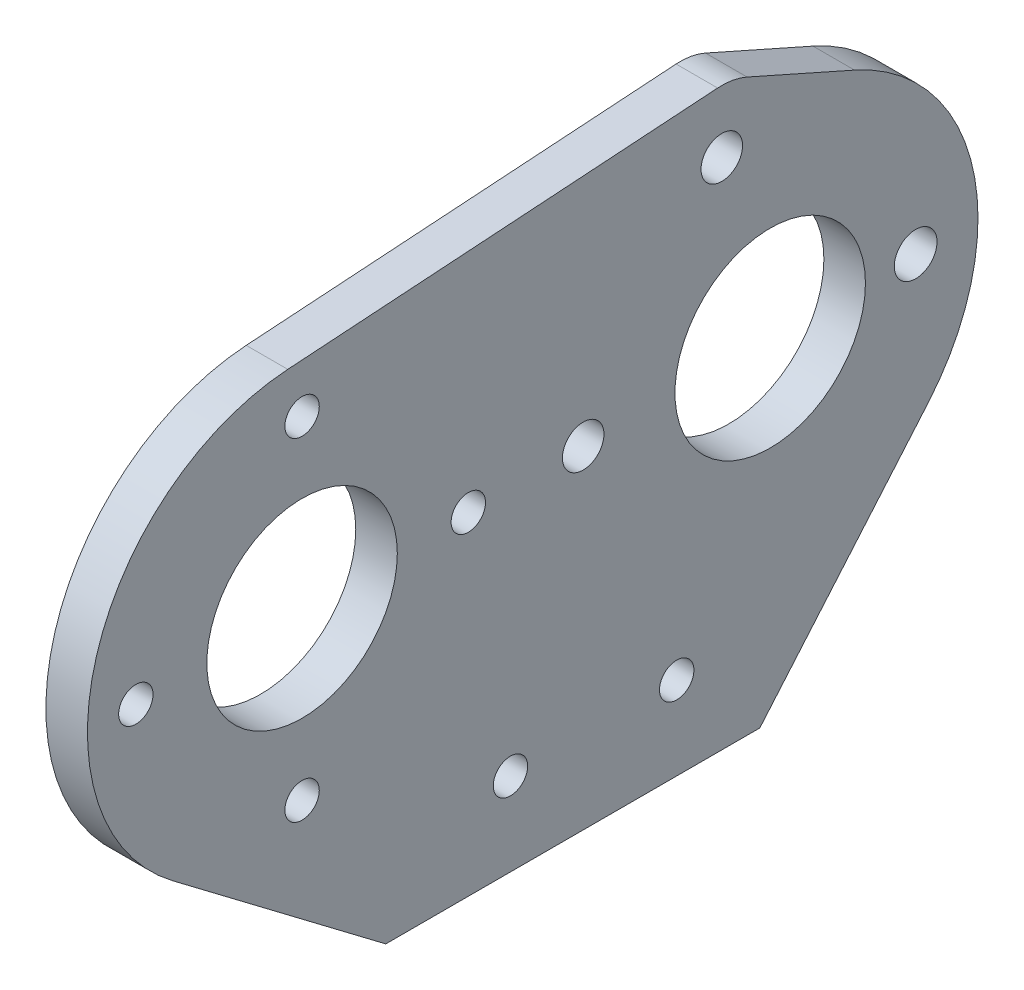
ISO-10303-21;
HEADER;
FILE_DESCRIPTION(('STEP AP214'),'2;1');
FILE_NAME('part.step','',(''),(''),'','','');
FILE_SCHEMA(('AUTOMOTIVE_DESIGN { 1 0 10303 214 1 1 1 1 }'));
ENDSEC;
DATA;
#1=APPLICATION_CONTEXT('core data for automotive mechanical design processes');
#2=APPLICATION_PROTOCOL_DEFINITION('international standard','automotive_design',2000,#1);
#3=PRODUCT_CONTEXT('',#1,'mechanical');
#4=PRODUCT('Part','Part','',(#3));
#5=PRODUCT_RELATED_PRODUCT_CATEGORY('part','',(#4));
#6=PRODUCT_DEFINITION_FORMATION('','',#4);
#7=PRODUCT_DEFINITION_CONTEXT('part definition',#1,'design');
#8=PRODUCT_DEFINITION('design','',#6,#7);
#9=PRODUCT_DEFINITION_SHAPE('','',#8);
#10=(LENGTH_UNIT() NAMED_UNIT(*) SI_UNIT(.MILLI.,.METRE.));
#11=(NAMED_UNIT(*) PLANE_ANGLE_UNIT() SI_UNIT($,.RADIAN.));
#12=(NAMED_UNIT(*) SI_UNIT($,.STERADIAN.) SOLID_ANGLE_UNIT());
#13=UNCERTAINTY_MEASURE_WITH_UNIT(LENGTH_MEASURE(1.E-05),#10,'distance_accuracy_value','');
#14=(GEOMETRIC_REPRESENTATION_CONTEXT(3) GLOBAL_UNCERTAINTY_ASSIGNED_CONTEXT((#13)) GLOBAL_UNIT_ASSIGNED_CONTEXT((#10,
#11,#12)) REPRESENTATION_CONTEXT('',''));
#15=CARTESIAN_POINT('',(0.,0.,0.));
#16=DIRECTION('',(0.,0.,1.));
#17=DIRECTION('',(1.,0.,0.));
#18=AXIS2_PLACEMENT_3D('',#15,#16,#17);
#19=CARTESIAN_POINT('',(6.35,50.8,-77.7875));
#20=DIRECTION('',(1.,0.,0.));
#21=DIRECTION('',(0.,0.,-1.));
#22=AXIS2_PLACEMENT_3D('',#19,#20,#21);
#23=PLANE('',#22);
#24=CARTESIAN_POINT('',(6.35,78.4013304862101,-70.3917457861956));
#25=DIRECTION('',(1.,0.,0.));
#26=DIRECTION('',(0.,0.,-1.));
#27=AXIS2_PLACEMENT_3D('',#24,#25,#26);
#28=CIRCLE('',#27,3.175);
#29=CARTESIAN_POINT('',(6.35,78.4013304862101,-73.5667457861956));
#30=VERTEX_POINT('',#29);
#31=EDGE_CURVE('E234',#30,#30,#28,.T.);
#32=ORIENTED_EDGE('',*,*,#31,.F.);
#33=EDGE_LOOP('',(#32));
#34=FACE_BOUND('',#33,.T.);
#35=CARTESIAN_POINT('',(6.35,50.8,19.1389));
#36=DIRECTION('',(1.,0.,0.));
#37=DIRECTION('',(0.,0.,-1.));
#38=AXIS2_PLACEMENT_3D('',#35,#36,#37);
#39=CIRCLE('',#38,2.62890000000003);
#40=CARTESIAN_POINT('',(6.35,50.8,16.51));
#41=VERTEX_POINT('',#40);
#42=EDGE_CURVE('E222',#41,#41,#39,.T.);
#43=ORIENTED_EDGE('',*,*,#42,.F.);
#44=EDGE_LOOP('',(#43));
#45=FACE_BOUND('',#44,.T.);
#46=CARTESIAN_POINT('',(6.35,25.4,-6.26110000000001));
#47=DIRECTION('',(1.,0.,0.));
#48=DIRECTION('',(0.,0.,-1.));
#49=AXIS2_PLACEMENT_3D('',#46,#47,#48);
#50=CIRCLE('',#49,2.62890000000002);
#51=CARTESIAN_POINT('',(6.35,25.4,-8.89000000000003));
#52=VERTEX_POINT('',#51);
#53=EDGE_CURVE('E210',#52,#52,#50,.T.);
#54=ORIENTED_EDGE('',*,*,#53,.F.);
#55=EDGE_LOOP('',(#54));
#56=FACE_BOUND('',#55,.T.);
#57=CARTESIAN_POINT('',(6.35,50.8,-77.7875));
#58=DIRECTION('',(1.,0.,0.));
#59=DIRECTION('',(0.,0.,-1.));
#60=AXIS2_PLACEMENT_3D('',#57,#58,#59);
#61=CIRCLE('',#60,14.5542);
#62=CARTESIAN_POINT('',(6.35,50.8,-92.3417));
#63=VERTEX_POINT('',#62);
#64=EDGE_CURVE('E198',#63,#63,#61,.T.);
#65=ORIENTED_EDGE('',*,*,#64,.F.);
#66=EDGE_LOOP('',(#65));
#67=FACE_BOUND('',#66,.T.);
#68=CARTESIAN_POINT('',(6.35,12.7,-38.1));
#69=DIRECTION('',(1.,0.,0.));
#70=DIRECTION('',(0.,0.,-1.));
#71=AXIS2_PLACEMENT_3D('',#68,#69,#70);
#72=CIRCLE('',#71,2.6289);
#73=CARTESIAN_POINT('',(6.35,12.7,-40.7289));
#74=VERTEX_POINT('',#73);
#75=EDGE_CURVE('E186',#74,#74,#72,.T.);
#76=ORIENTED_EDGE('',*,*,#75,.F.);
#77=EDGE_LOOP('',(#76));
#78=FACE_BOUND('',#77,.T.);
#79=DIRECTION('',(0.,0.,-1.));
#80=VECTOR('',#79,1.);
#81=CARTESIAN_POINT('',(6.35,0.,-19.05));
#82=LINE('',#81,#80);
#83=CARTESIAN_POINT('',(6.35,0.,-19.05));
#84=VERTEX_POINT('',#83);
#85=CARTESIAN_POINT('',(6.35,0.,-76.2));
#86=VERTEX_POINT('',#85);
#87=EDGE_CURVE('E149',#84,#86,#82,.T.);
#88=ORIENTED_EDGE('',*,*,#87,.T.);
#89=DIRECTION('',(0.,0.760975609756097,-0.648780487804878));
#90=VECTOR('',#89,1.);
#91=CARTESIAN_POINT('',(6.35,0.,-76.2));
#92=LINE('',#91,#90);
#93=CARTESIAN_POINT('',(6.35,30.2012195121951,-101.948475609756));
#94=VERTEX_POINT('',#93);
#95=EDGE_CURVE('E97',#86,#94,#92,.T.);
#96=ORIENTED_EDGE('',*,*,#95,.T.);
#97=CARTESIAN_POINT('',(6.35,50.8,-77.7875));
#98=DIRECTION('',(1.,0.,0.));
#99=DIRECTION('',(0.,0.,-1.));
#100=AXIS2_PLACEMENT_3D('',#97,#98,#99);
#101=CIRCLE('',#100,31.75);
#102=CARTESIAN_POINT('',(6.35,79.818026797041,-90.6722437229544));
#103=VERTEX_POINT('',#102);
#104=EDGE_CURVE('E164',#94,#103,#101,.T.);
#105=ORIENTED_EDGE('',*,*,#104,.T.);
#106=DIRECTION('',(0.,0.405818699935571,0.913953599906802));
#107=VECTOR('',#106,1.);
#108=CARTESIAN_POINT('',(6.35,79.818026797041,-90.6722437229544));
#109=LINE('',#108,#107);
#110=CARTESIAN_POINT('',(6.35,87.1067385253224,-74.2571689030819));
#111=VERTEX_POINT('',#110);
#112=EDGE_CURVE('E177',#103,#111,#109,.T.);
#113=ORIENTED_EDGE('',*,*,#112,.T.);
#114=CARTESIAN_POINT('',(6.35,78.4013304862101,-70.3917457861956));
#115=DIRECTION('',(1.,0.,0.));
#116=DIRECTION('',(0.,0.,1.));
#117=AXIS2_PLACEMENT_3D('',#114,#115,#116);
#118=CIRCLE('',#117,9.52500000000001);
#119=CARTESIAN_POINT('',(6.35,87.9051580954357,-69.7570129493875));
#120=VERTEX_POINT('',#119);
#121=EDGE_CURVE('E116',#111,#120,#118,.T.);
#122=ORIENTED_EDGE('',*,*,#121,.T.);
#123=DIRECTION('',(0.,-0.0666386180375886,0.997777176821579));
#124=VECTOR('',#123,1.);
#125=CARTESIAN_POINT('',(6.35,87.9051580954357,-69.7570129493875));
#126=LINE('',#125,#124);
#127=CARTESIAN_POINT('',(6.35,83.5185105160271,-4.07592642048224));
#128=VERTEX_POINT('',#127);
#129=EDGE_CURVE('E110',#120,#128,#126,.T.);
#130=ORIENTED_EDGE('',*,*,#129,.T.);
#131=CARTESIAN_POINT('',(6.35,50.8,-6.26110000000001));
#132=DIRECTION('',(1.,0.,0.));
#133=DIRECTION('',(0.,0.,-1.));
#134=AXIS2_PLACEMENT_3D('',#131,#132,#133);
#135=CIRCLE('',#134,32.7914);
#136=CARTESIAN_POINT('',(6.35,24.6516746454702,13.5262948541402));
#137=VERTEX_POINT('',#136);
#138=EDGE_CURVE('E114',#128,#137,#135,.T.);
#139=ORIENTED_EDGE('',*,*,#138,.T.);
#140=DIRECTION('',(0.,-0.603432450402856,-0.797414119388919));
#141=VECTOR('',#140,1.);
#142=CARTESIAN_POINT('',(6.35,0.,-19.05));
#143=LINE('',#142,#141);
#144=EDGE_CURVE('E54',#137,#84,#143,.T.);
#145=ORIENTED_EDGE('',*,*,#144,.T.);
#146=EDGE_LOOP('',(#88,#96,#105,#113,#122,#130,#139,#145));
#147=FACE_BOUND('',#146,.T.);
#148=CARTESIAN_POINT('',(6.35,50.8,-6.26110000000001));
#149=DIRECTION('',(1.,0.,0.));
#150=DIRECTION('',(0.,0.,-1.));
#151=AXIS2_PLACEMENT_3D('',#148,#149,#150);
#152=CIRCLE('',#151,14.5542);
#153=CARTESIAN_POINT('',(6.35,50.8,-20.8153));
#154=VERTEX_POINT('',#153);
#155=EDGE_CURVE('E138',#154,#154,#152,.T.);
#156=ORIENTED_EDGE('',*,*,#155,.F.);
#157=EDGE_LOOP('',(#156));
#158=FACE_BOUND('',#157,.T.);
#159=CARTESIAN_POINT('',(6.35,12.7,-63.5));
#160=DIRECTION('',(1.,0.,0.));
#161=DIRECTION('',(0.,0.,-1.));
#162=AXIS2_PLACEMENT_3D('',#159,#160,#161);
#163=CIRCLE('',#162,2.62890000000001);
#164=CARTESIAN_POINT('',(6.35,12.7,-66.1289));
#165=VERTEX_POINT('',#164);
#166=EDGE_CURVE('E192',#165,#165,#163,.T.);
#167=ORIENTED_EDGE('',*,*,#166,.F.);
#168=EDGE_LOOP('',(#167));
#169=FACE_BOUND('',#168,.T.);
#170=CARTESIAN_POINT('',(6.35,76.2,-6.26110000000001));
#171=DIRECTION('',(1.,0.,0.));
#172=DIRECTION('',(0.,0.,-1.));
#173=AXIS2_PLACEMENT_3D('',#170,#171,#172);
#174=CIRCLE('',#173,2.62890000000003);
#175=CARTESIAN_POINT('',(6.35,76.2,-8.89000000000004));
#176=VERTEX_POINT('',#175);
#177=EDGE_CURVE('E204',#176,#176,#174,.T.);
#178=ORIENTED_EDGE('',*,*,#177,.F.);
#179=EDGE_LOOP('',(#178));
#180=FACE_BOUND('',#179,.T.);
#181=CARTESIAN_POINT('',(6.35,50.8,-31.6611));
#182=DIRECTION('',(1.,0.,0.));
#183=DIRECTION('',(0.,0.,-1.));
#184=AXIS2_PLACEMENT_3D('',#181,#182,#183);
#185=CIRCLE('',#184,2.62890000000003);
#186=CARTESIAN_POINT('',(6.35,50.8,-34.29));
#187=VERTEX_POINT('',#186);
#188=EDGE_CURVE('E216',#187,#187,#185,.T.);
#189=ORIENTED_EDGE('',*,*,#188,.F.);
#190=EDGE_LOOP('',(#189));
#191=FACE_BOUND('',#190,.T.);
#192=CARTESIAN_POINT('',(6.35,50.8,-49.2125));
#193=DIRECTION('',(1.,0.,0.));
#194=DIRECTION('',(0.,0.,-1.));
#195=AXIS2_PLACEMENT_3D('',#192,#193,#194);
#196=CIRCLE('',#195,3.175);
#197=CARTESIAN_POINT('',(6.35,50.8,-52.3875));
#198=VERTEX_POINT('',#197);
#199=EDGE_CURVE('E228',#198,#198,#196,.T.);
#200=ORIENTED_EDGE('',*,*,#199,.F.);
#201=EDGE_LOOP('',(#200));
#202=FACE_BOUND('',#201,.T.);
#203=CARTESIAN_POINT('',(6.35,50.8,-100.0125));
#204=DIRECTION('',(1.,0.,0.));
#205=DIRECTION('',(0.,0.,-1.));
#206=AXIS2_PLACEMENT_3D('',#203,#204,#205);
#207=CIRCLE('',#206,3.2639);
#208=CARTESIAN_POINT('',(6.35,50.8,-103.2764));
#209=VERTEX_POINT('',#208);
#210=EDGE_CURVE('E240',#209,#209,#207,.T.);
#211=ORIENTED_EDGE('',*,*,#210,.F.);
#212=EDGE_LOOP('',(#211));
#213=FACE_BOUND('',#212,.T.);
#214=ADVANCED_FACE('F37',(#34,#45,#56,#67,#78,#147,#158,#169,#180,#191,#202,#213),#23,.T.);
#215=CARTESIAN_POINT('',(0.,50.8,-77.7875));
#216=DIRECTION('',(1.,0.,0.));
#217=DIRECTION('',(0.,0.,-1.));
#218=AXIS2_PLACEMENT_3D('',#215,#216,#217);
#219=PLANE('',#218);
#220=DIRECTION('',(0.,0.,-1.));
#221=VECTOR('',#220,1.);
#222=CARTESIAN_POINT('',(0.,0.,-19.05));
#223=LINE('',#222,#221);
#224=CARTESIAN_POINT('',(0.,0.,-19.05));
#225=VERTEX_POINT('',#224);
#226=CARTESIAN_POINT('',(0.,0.,-76.2));
#227=VERTEX_POINT('',#226);
#228=EDGE_CURVE('E134',#225,#227,#223,.T.);
#229=ORIENTED_EDGE('',*,*,#228,.F.);
#230=DIRECTION('',(0.,-0.603432450402856,-0.797414119388919));
#231=VECTOR('',#230,1.);
#232=CARTESIAN_POINT('',(0.,0.,-19.05));
#233=LINE('',#232,#231);
#234=CARTESIAN_POINT('',(0.,24.6516746454702,13.5262948541402));
#235=VERTEX_POINT('',#234);
#236=EDGE_CURVE('E89',#235,#225,#233,.T.);
#237=ORIENTED_EDGE('',*,*,#236,.F.);
#238=CARTESIAN_POINT('',(0.,50.8,-6.26110000000001));
#239=DIRECTION('',(1.,0.,0.));
#240=DIRECTION('',(0.,0.,-1.));
#241=AXIS2_PLACEMENT_3D('',#238,#239,#240);
#242=CIRCLE('',#241,32.7914);
#243=CARTESIAN_POINT('',(0.,83.5185105160271,-4.07592642048224));
#244=VERTEX_POINT('',#243);
#245=EDGE_CURVE('E83',#244,#235,#242,.T.);
#246=ORIENTED_EDGE('',*,*,#245,.F.);
#247=DIRECTION('',(0.,-0.0666386180375886,0.997777176821579));
#248=VECTOR('',#247,1.);
#249=CARTESIAN_POINT('',(0.,87.9051580954357,-69.7570129493875));
#250=LINE('',#249,#248);
#251=CARTESIAN_POINT('',(0.,87.9051580954357,-69.7570129493875));
#252=VERTEX_POINT('',#251);
#253=EDGE_CURVE('E124',#252,#244,#250,.T.);
#254=ORIENTED_EDGE('',*,*,#253,.F.);
#255=CARTESIAN_POINT('',(0.,78.4013304862101,-70.3917457861956));
#256=DIRECTION('',(1.,0.,0.));
#257=DIRECTION('',(0.,0.,1.));
#258=AXIS2_PLACEMENT_3D('',#255,#256,#257);
#259=CIRCLE('',#258,9.52500000000001);
#260=CARTESIAN_POINT('',(0.,87.1067385253224,-74.2571689030819));
#261=VERTEX_POINT('',#260);
#262=EDGE_CURVE('E144',#261,#252,#259,.T.);
#263=ORIENTED_EDGE('',*,*,#262,.F.);
#264=DIRECTION('',(0.,0.405818699935571,0.913953599906802));
#265=VECTOR('',#264,1.);
#266=CARTESIAN_POINT('',(0.,79.818026797041,-90.6722437229544));
#267=LINE('',#266,#265);
#268=CARTESIAN_POINT('',(0.,79.818026797041,-90.6722437229544));
#269=VERTEX_POINT('',#268);
#270=EDGE_CURVE('E142',#269,#261,#267,.T.);
#271=ORIENTED_EDGE('',*,*,#270,.F.);
#272=CARTESIAN_POINT('',(0.,50.8,-77.7875));
#273=DIRECTION('',(1.,0.,0.));
#274=DIRECTION('',(0.,0.,-1.));
#275=AXIS2_PLACEMENT_3D('',#272,#273,#274);
#276=CIRCLE('',#275,31.75);
#277=CARTESIAN_POINT('',(0.,30.2012195121951,-101.948475609756));
#278=VERTEX_POINT('',#277);
#279=EDGE_CURVE('E140',#278,#269,#276,.T.);
#280=ORIENTED_EDGE('',*,*,#279,.F.);
#281=DIRECTION('',(0.,0.760975609756097,-0.648780487804878));
#282=VECTOR('',#281,1.);
#283=CARTESIAN_POINT('',(0.,0.,-76.2));
#284=LINE('',#283,#282);
#285=EDGE_CURVE('E137',#227,#278,#284,.T.);
#286=ORIENTED_EDGE('',*,*,#285,.F.);
#287=EDGE_LOOP('',(#229,#237,#246,#254,#263,#271,#280,#286));
#288=FACE_BOUND('',#287,.T.);
#289=CARTESIAN_POINT('',(0.,50.8,-6.26110000000001));
#290=DIRECTION('',(1.,0.,0.));
#291=DIRECTION('',(0.,0.,-1.));
#292=AXIS2_PLACEMENT_3D('',#289,#290,#291);
#293=CIRCLE('',#292,14.5542);
#294=CARTESIAN_POINT('',(0.,50.8,-20.8153));
#295=VERTEX_POINT('',#294);
#296=EDGE_CURVE('E183',#295,#295,#293,.T.);
#297=ORIENTED_EDGE('',*,*,#296,.T.);
#298=EDGE_LOOP('',(#297));
#299=FACE_BOUND('',#298,.T.);
#300=CARTESIAN_POINT('',(0.,12.7,-38.1));
#301=DIRECTION('',(1.,0.,0.));
#302=DIRECTION('',(0.,0.,-1.));
#303=AXIS2_PLACEMENT_3D('',#300,#301,#302);
#304=CIRCLE('',#303,2.6289);
#305=CARTESIAN_POINT('',(0.,12.7,-40.7289));
#306=VERTEX_POINT('',#305);
#307=EDGE_CURVE('E189',#306,#306,#304,.T.);
#308=ORIENTED_EDGE('',*,*,#307,.T.);
#309=EDGE_LOOP('',(#308));
#310=FACE_BOUND('',#309,.T.);
#311=CARTESIAN_POINT('',(0.,12.7,-63.5));
#312=DIRECTION('',(1.,0.,0.));
#313=DIRECTION('',(0.,0.,-1.));
#314=AXIS2_PLACEMENT_3D('',#311,#312,#313);
#315=CIRCLE('',#314,2.62890000000001);
#316=CARTESIAN_POINT('',(0.,12.7,-66.1289));
#317=VERTEX_POINT('',#316);
#318=EDGE_CURVE('E195',#317,#317,#315,.T.);
#319=ORIENTED_EDGE('',*,*,#318,.T.);
#320=EDGE_LOOP('',(#319));
#321=FACE_BOUND('',#320,.T.);
#322=CARTESIAN_POINT('',(0.,50.8,-77.7875));
#323=DIRECTION('',(1.,0.,0.));
#324=DIRECTION('',(0.,0.,-1.));
#325=AXIS2_PLACEMENT_3D('',#322,#323,#324);
#326=CIRCLE('',#325,14.5542);
#327=CARTESIAN_POINT('',(0.,50.8,-92.3417));
#328=VERTEX_POINT('',#327);
#329=EDGE_CURVE('E201',#328,#328,#326,.T.);
#330=ORIENTED_EDGE('',*,*,#329,.T.);
#331=EDGE_LOOP('',(#330));
#332=FACE_BOUND('',#331,.T.);
#333=CARTESIAN_POINT('',(0.,76.2,-6.26110000000001));
#334=DIRECTION('',(1.,0.,0.));
#335=DIRECTION('',(0.,0.,-1.));
#336=AXIS2_PLACEMENT_3D('',#333,#334,#335);
#337=CIRCLE('',#336,2.62890000000003);
#338=CARTESIAN_POINT('',(0.,76.2,-8.89000000000004));
#339=VERTEX_POINT('',#338);
#340=EDGE_CURVE('E207',#339,#339,#337,.T.);
#341=ORIENTED_EDGE('',*,*,#340,.T.);
#342=EDGE_LOOP('',(#341));
#343=FACE_BOUND('',#342,.T.);
#344=CARTESIAN_POINT('',(0.,25.4,-6.26110000000001));
#345=DIRECTION('',(1.,0.,0.));
#346=DIRECTION('',(0.,0.,-1.));
#347=AXIS2_PLACEMENT_3D('',#344,#345,#346);
#348=CIRCLE('',#347,2.62890000000002);
#349=CARTESIAN_POINT('',(0.,25.4,-8.89000000000003));
#350=VERTEX_POINT('',#349);
#351=EDGE_CURVE('E213',#350,#350,#348,.T.);
#352=ORIENTED_EDGE('',*,*,#351,.T.);
#353=EDGE_LOOP('',(#352));
#354=FACE_BOUND('',#353,.T.);
#355=CARTESIAN_POINT('',(0.,50.8,-31.6611));
#356=DIRECTION('',(1.,0.,0.));
#357=DIRECTION('',(0.,0.,-1.));
#358=AXIS2_PLACEMENT_3D('',#355,#356,#357);
#359=CIRCLE('',#358,2.62890000000003);
#360=CARTESIAN_POINT('',(0.,50.8,-34.29));
#361=VERTEX_POINT('',#360);
#362=EDGE_CURVE('E219',#361,#361,#359,.T.);
#363=ORIENTED_EDGE('',*,*,#362,.T.);
#364=EDGE_LOOP('',(#363));
#365=FACE_BOUND('',#364,.T.);
#366=CARTESIAN_POINT('',(0.,50.8,19.1389));
#367=DIRECTION('',(1.,0.,0.));
#368=DIRECTION('',(0.,0.,-1.));
#369=AXIS2_PLACEMENT_3D('',#366,#367,#368);
#370=CIRCLE('',#369,2.62890000000003);
#371=CARTESIAN_POINT('',(0.,50.8,16.51));
#372=VERTEX_POINT('',#371);
#373=EDGE_CURVE('E225',#372,#372,#370,.T.);
#374=ORIENTED_EDGE('',*,*,#373,.T.);
#375=EDGE_LOOP('',(#374));
#376=FACE_BOUND('',#375,.T.);
#377=CARTESIAN_POINT('',(0.,50.8,-49.2125));
#378=DIRECTION('',(1.,0.,0.));
#379=DIRECTION('',(0.,0.,-1.));
#380=AXIS2_PLACEMENT_3D('',#377,#378,#379);
#381=CIRCLE('',#380,3.175);
#382=CARTESIAN_POINT('',(0.,50.8,-52.3875));
#383=VERTEX_POINT('',#382);
#384=EDGE_CURVE('E231',#383,#383,#381,.T.);
#385=ORIENTED_EDGE('',*,*,#384,.T.);
#386=EDGE_LOOP('',(#385));
#387=FACE_BOUND('',#386,.T.);
#388=CARTESIAN_POINT('',(0.,78.4013304862101,-70.3917457861956));
#389=DIRECTION('',(1.,0.,0.));
#390=DIRECTION('',(0.,0.,-1.));
#391=AXIS2_PLACEMENT_3D('',#388,#389,#390);
#392=CIRCLE('',#391,3.175);
#393=CARTESIAN_POINT('',(0.,78.4013304862101,-73.5667457861956));
#394=VERTEX_POINT('',#393);
#395=EDGE_CURVE('E237',#394,#394,#392,.T.);
#396=ORIENTED_EDGE('',*,*,#395,.T.);
#397=EDGE_LOOP('',(#396));
#398=FACE_BOUND('',#397,.T.);
#399=CARTESIAN_POINT('',(0.,50.8,-100.0125));
#400=DIRECTION('',(1.,0.,0.));
#401=DIRECTION('',(0.,0.,-1.));
#402=AXIS2_PLACEMENT_3D('',#399,#400,#401);
#403=CIRCLE('',#402,3.2639);
#404=CARTESIAN_POINT('',(0.,50.8,-103.2764));
#405=VERTEX_POINT('',#404);
#406=EDGE_CURVE('E243',#405,#405,#403,.T.);
#407=ORIENTED_EDGE('',*,*,#406,.T.);
#408=EDGE_LOOP('',(#407));
#409=FACE_BOUND('',#408,.T.);
#410=ADVANCED_FACE('F168',(#288,#299,#310,#321,#332,#343,#354,#365,#376,#387,#398,#409),#219,.F.);
#411=CARTESIAN_POINT('',(6.35,0.,-19.05));
#412=DIRECTION('',(0.,1.,0.));
#413=DIRECTION('',(0.,0.,1.));
#414=AXIS2_PLACEMENT_3D('',#411,#412,#413);
#415=PLANE('',#414);
#416=ORIENTED_EDGE('',*,*,#228,.T.);
#417=DIRECTION('',(-1.,0.,0.));
#418=VECTOR('',#417,1.);
#419=CARTESIAN_POINT('',(6.35,0.,-76.2));
#420=LINE('',#419,#418);
#421=EDGE_CURVE('E11',#86,#227,#420,.T.);
#422=ORIENTED_EDGE('',*,*,#421,.F.);
#423=ORIENTED_EDGE('',*,*,#87,.F.);
#424=DIRECTION('',(-1.,0.,0.));
#425=VECTOR('',#424,1.);
#426=CARTESIAN_POINT('',(6.35,0.,-19.05));
#427=LINE('',#426,#425);
#428=EDGE_CURVE('E130',#84,#225,#427,.T.);
#429=ORIENTED_EDGE('',*,*,#428,.T.);
#430=EDGE_LOOP('',(#416,#422,#423,#429));
#431=FACE_BOUND('',#430,.T.);
#432=ADVANCED_FACE('F39',(#431),#415,.F.);
#433=CARTESIAN_POINT('',(6.35,0.,-76.2));
#434=DIRECTION('',(0.,0.648780487804878,0.760975609756098));
#435=DIRECTION('',(0.,-0.760975609756098,0.648780487804878));
#436=AXIS2_PLACEMENT_3D('',#433,#434,#435);
#437=PLANE('',#436);
#438=ORIENTED_EDGE('',*,*,#285,.T.);
#439=DIRECTION('',(-1.,0.,0.));
#440=VECTOR('',#439,1.);
#441=CARTESIAN_POINT('',(6.35,30.2012195121951,-101.948475609756));
#442=LINE('',#441,#440);
#443=EDGE_CURVE('E46',#94,#278,#442,.T.);
#444=ORIENTED_EDGE('',*,*,#443,.F.);
#445=ORIENTED_EDGE('',*,*,#95,.F.);
#446=ORIENTED_EDGE('',*,*,#421,.T.);
#447=EDGE_LOOP('',(#438,#444,#445,#446));
#448=FACE_BOUND('',#447,.T.);
#449=ADVANCED_FACE('F277',(#448),#437,.F.);
#450=CARTESIAN_POINT('',(6.35,50.8,-77.7875));
#451=DIRECTION('',(-1.,0.,0.));
#452=DIRECTION('',(0.,0.,1.));
#453=AXIS2_PLACEMENT_3D('',#450,#451,#452);
#454=CYLINDRICAL_SURFACE('',#453,31.75);
#455=ORIENTED_EDGE('',*,*,#279,.T.);
#456=DIRECTION('',(-1.,0.,0.));
#457=VECTOR('',#456,1.);
#458=CARTESIAN_POINT('',(6.35,79.818026797041,-90.6722437229544));
#459=LINE('',#458,#457);
#460=EDGE_CURVE('E156',#103,#269,#459,.T.);
#461=ORIENTED_EDGE('',*,*,#460,.F.);
#462=ORIENTED_EDGE('',*,*,#104,.F.);
#463=ORIENTED_EDGE('',*,*,#443,.T.);
#464=EDGE_LOOP('',(#455,#461,#462,#463));
#465=FACE_BOUND('',#464,.T.);
#466=ADVANCED_FACE('F162',(#465),#454,.T.);
#467=CARTESIAN_POINT('',(6.35,79.818026797041,-90.6722437229544));
#468=DIRECTION('',(0.,-0.913953599906802,0.405818699935571));
#469=DIRECTION('',(0.,-0.405818699935571,-0.913953599906802));
#470=AXIS2_PLACEMENT_3D('',#467,#468,#469);
#471=PLANE('',#470);
#472=ORIENTED_EDGE('',*,*,#270,.T.);
#473=DIRECTION('',(-1.,0.,0.));
#474=VECTOR('',#473,1.);
#475=CARTESIAN_POINT('',(6.35,87.1067385253224,-74.2571689030819));
#476=LINE('',#475,#474);
#477=EDGE_CURVE('E153',#111,#261,#476,.T.);
#478=ORIENTED_EDGE('',*,*,#477,.F.);
#479=ORIENTED_EDGE('',*,*,#112,.F.);
#480=ORIENTED_EDGE('',*,*,#460,.T.);
#481=EDGE_LOOP('',(#472,#478,#479,#480));
#482=FACE_BOUND('',#481,.T.);
#483=ADVANCED_FACE('F173',(#482),#471,.F.);
#484=CARTESIAN_POINT('',(6.35,78.4013304862101,-70.3917457861956));
#485=DIRECTION('',(-1.,0.,0.));
#486=DIRECTION('',(0.,0.,1.));
#487=AXIS2_PLACEMENT_3D('',#484,#485,#486);
#488=CYLINDRICAL_SURFACE('',#487,9.52500000000001);
#489=ORIENTED_EDGE('',*,*,#262,.T.);
#490=DIRECTION('',(-1.,0.,0.));
#491=VECTOR('',#490,1.);
#492=CARTESIAN_POINT('',(6.35,87.9051580954357,-69.7570129493875));
#493=LINE('',#492,#491);
#494=EDGE_CURVE('E125',#120,#252,#493,.T.);
#495=ORIENTED_EDGE('',*,*,#494,.F.);
#496=ORIENTED_EDGE('',*,*,#121,.F.);
#497=ORIENTED_EDGE('',*,*,#477,.T.);
#498=EDGE_LOOP('',(#489,#495,#496,#497));
#499=FACE_BOUND('',#498,.T.);
#500=ADVANCED_FACE('F176',(#499),#488,.T.);
#501=CARTESIAN_POINT('',(6.35,87.9051580954357,-69.7570129493875));
#502=DIRECTION('',(0.,-0.997777176821579,-0.0666386180375886));
#503=DIRECTION('',(0.,0.0666386180375886,-0.997777176821579));
#504=AXIS2_PLACEMENT_3D('',#501,#502,#503);
#505=PLANE('',#504);
#506=ORIENTED_EDGE('',*,*,#253,.T.);
#507=DIRECTION('',(-1.,0.,0.));
#508=VECTOR('',#507,1.);
#509=CARTESIAN_POINT('',(6.35,83.5185105160271,-4.07592642048224));
#510=LINE('',#509,#508);
#511=EDGE_CURVE('E121',#128,#244,#510,.T.);
#512=ORIENTED_EDGE('',*,*,#511,.F.);
#513=ORIENTED_EDGE('',*,*,#129,.F.);
#514=ORIENTED_EDGE('',*,*,#494,.T.);
#515=EDGE_LOOP('',(#506,#512,#513,#514));
#516=FACE_BOUND('',#515,.T.);
#517=ADVANCED_FACE('F122',(#516),#505,.F.);
#518=CARTESIAN_POINT('',(6.35,50.8,-6.26110000000001));
#519=DIRECTION('',(-1.,0.,0.));
#520=DIRECTION('',(0.,0.,1.));
#521=AXIS2_PLACEMENT_3D('',#518,#519,#520);
#522=CYLINDRICAL_SURFACE('',#521,32.7914);
#523=ORIENTED_EDGE('',*,*,#245,.T.);
#524=DIRECTION('',(-1.,0.,0.));
#525=VECTOR('',#524,1.);
#526=CARTESIAN_POINT('',(6.35,24.6516746454702,13.5262948541402));
#527=LINE('',#526,#525);
#528=EDGE_CURVE('E126',#137,#235,#527,.T.);
#529=ORIENTED_EDGE('',*,*,#528,.F.);
#530=ORIENTED_EDGE('',*,*,#138,.F.);
#531=ORIENTED_EDGE('',*,*,#511,.T.);
#532=EDGE_LOOP('',(#523,#529,#530,#531));
#533=FACE_BOUND('',#532,.T.);
#534=ADVANCED_FACE('F128',(#533),#522,.T.);
#535=CARTESIAN_POINT('',(6.35,0.,-19.05));
#536=DIRECTION('',(0.,0.797414119388919,-0.603432450402856));
#537=DIRECTION('',(0.,0.603432450402856,0.797414119388919));
#538=AXIS2_PLACEMENT_3D('',#535,#536,#537);
#539=PLANE('',#538);
#540=ORIENTED_EDGE('',*,*,#236,.T.);
#541=ORIENTED_EDGE('',*,*,#428,.F.);
#542=ORIENTED_EDGE('',*,*,#144,.F.);
#543=ORIENTED_EDGE('',*,*,#528,.T.);
#544=EDGE_LOOP('',(#540,#541,#542,#543));
#545=FACE_BOUND('',#544,.T.);
#546=ADVANCED_FACE('F265',(#545),#539,.F.);
#547=CARTESIAN_POINT('',(6.35,50.8,-6.26110000000001));
#548=DIRECTION('',(-1.,0.,0.));
#549=DIRECTION('',(0.,0.,1.));
#550=AXIS2_PLACEMENT_3D('',#547,#548,#549);
#551=CYLINDRICAL_SURFACE('',#550,14.5542);
#552=ORIENTED_EDGE('',*,*,#155,.T.);
#553=EDGE_LOOP('',(#552));
#554=FACE_BOUND('',#553,.T.);
#555=ORIENTED_EDGE('',*,*,#296,.F.);
#556=EDGE_LOOP('',(#555));
#557=FACE_BOUND('',#556,.T.);
#558=ADVANCED_FACE('F262',(#554,#557),#551,.F.);
#559=CARTESIAN_POINT('',(6.35,12.7,-38.1));
#560=DIRECTION('',(-1.,0.,0.));
#561=DIRECTION('',(0.,0.,1.));
#562=AXIS2_PLACEMENT_3D('',#559,#560,#561);
#563=CYLINDRICAL_SURFACE('',#562,2.6289);
#564=ORIENTED_EDGE('',*,*,#75,.T.);
#565=EDGE_LOOP('',(#564));
#566=FACE_BOUND('',#565,.T.);
#567=ORIENTED_EDGE('',*,*,#307,.F.);
#568=EDGE_LOOP('',(#567));
#569=FACE_BOUND('',#568,.T.);
#570=ADVANCED_FACE('F341',(#566,#569),#563,.F.);
#571=CARTESIAN_POINT('',(6.35,12.7,-63.5));
#572=DIRECTION('',(-1.,0.,0.));
#573=DIRECTION('',(0.,0.,1.));
#574=AXIS2_PLACEMENT_3D('',#571,#572,#573);
#575=CYLINDRICAL_SURFACE('',#574,2.62890000000001);
#576=ORIENTED_EDGE('',*,*,#166,.T.);
#577=EDGE_LOOP('',(#576));
#578=FACE_BOUND('',#577,.T.);
#579=ORIENTED_EDGE('',*,*,#318,.F.);
#580=EDGE_LOOP('',(#579));
#581=FACE_BOUND('',#580,.T.);
#582=ADVANCED_FACE('F349',(#578,#581),#575,.F.);
#583=CARTESIAN_POINT('',(6.35,50.8,-77.7875));
#584=DIRECTION('',(-1.,0.,0.));
#585=DIRECTION('',(0.,0.,1.));
#586=AXIS2_PLACEMENT_3D('',#583,#584,#585);
#587=CYLINDRICAL_SURFACE('',#586,14.5542);
#588=ORIENTED_EDGE('',*,*,#64,.T.);
#589=EDGE_LOOP('',(#588));
#590=FACE_BOUND('',#589,.T.);
#591=ORIENTED_EDGE('',*,*,#329,.F.);
#592=EDGE_LOOP('',(#591));
#593=FACE_BOUND('',#592,.T.);
#594=ADVANCED_FACE('F357',(#590,#593),#587,.F.);
#595=CARTESIAN_POINT('',(6.35,76.2,-6.26110000000001));
#596=DIRECTION('',(-1.,0.,0.));
#597=DIRECTION('',(0.,0.,1.));
#598=AXIS2_PLACEMENT_3D('',#595,#596,#597);
#599=CYLINDRICAL_SURFACE('',#598,2.62890000000003);
#600=ORIENTED_EDGE('',*,*,#177,.T.);
#601=EDGE_LOOP('',(#600));
#602=FACE_BOUND('',#601,.T.);
#603=ORIENTED_EDGE('',*,*,#340,.F.);
#604=EDGE_LOOP('',(#603));
#605=FACE_BOUND('',#604,.T.);
#606=ADVANCED_FACE('F366',(#602,#605),#599,.F.);
#607=CARTESIAN_POINT('',(6.35,25.4,-6.26110000000001));
#608=DIRECTION('',(-1.,0.,0.));
#609=DIRECTION('',(0.,0.,1.));
#610=AXIS2_PLACEMENT_3D('',#607,#608,#609);
#611=CYLINDRICAL_SURFACE('',#610,2.62890000000002);
#612=ORIENTED_EDGE('',*,*,#53,.T.);
#613=EDGE_LOOP('',(#612));
#614=FACE_BOUND('',#613,.T.);
#615=ORIENTED_EDGE('',*,*,#351,.F.);
#616=EDGE_LOOP('',(#615));
#617=FACE_BOUND('',#616,.T.);
#618=ADVANCED_FACE('F375',(#614,#617),#611,.F.);
#619=CARTESIAN_POINT('',(6.35,50.8,-31.6611));
#620=DIRECTION('',(-1.,0.,0.));
#621=DIRECTION('',(0.,0.,1.));
#622=AXIS2_PLACEMENT_3D('',#619,#620,#621);
#623=CYLINDRICAL_SURFACE('',#622,2.62890000000003);
#624=ORIENTED_EDGE('',*,*,#188,.T.);
#625=EDGE_LOOP('',(#624));
#626=FACE_BOUND('',#625,.T.);
#627=ORIENTED_EDGE('',*,*,#362,.F.);
#628=EDGE_LOOP('',(#627));
#629=FACE_BOUND('',#628,.T.);
#630=ADVANCED_FACE('F384',(#626,#629),#623,.F.);
#631=CARTESIAN_POINT('',(6.35,50.8,19.1389));
#632=DIRECTION('',(-1.,0.,0.));
#633=DIRECTION('',(0.,0.,1.));
#634=AXIS2_PLACEMENT_3D('',#631,#632,#633);
#635=CYLINDRICAL_SURFACE('',#634,2.62890000000003);
#636=ORIENTED_EDGE('',*,*,#42,.T.);
#637=EDGE_LOOP('',(#636));
#638=FACE_BOUND('',#637,.T.);
#639=ORIENTED_EDGE('',*,*,#373,.F.);
#640=EDGE_LOOP('',(#639));
#641=FACE_BOUND('',#640,.T.);
#642=ADVANCED_FACE('F393',(#638,#641),#635,.F.);
#643=CARTESIAN_POINT('',(6.35,50.8,-49.2125));
#644=DIRECTION('',(-1.,0.,0.));
#645=DIRECTION('',(0.,0.,1.));
#646=AXIS2_PLACEMENT_3D('',#643,#644,#645);
#647=CYLINDRICAL_SURFACE('',#646,3.175);
#648=ORIENTED_EDGE('',*,*,#199,.T.);
#649=EDGE_LOOP('',(#648));
#650=FACE_BOUND('',#649,.T.);
#651=ORIENTED_EDGE('',*,*,#384,.F.);
#652=EDGE_LOOP('',(#651));
#653=FACE_BOUND('',#652,.T.);
#654=ADVANCED_FACE('F402',(#650,#653),#647,.F.);
#655=CARTESIAN_POINT('',(6.35,78.4013304862101,-70.3917457861956));
#656=DIRECTION('',(-1.,0.,0.));
#657=DIRECTION('',(0.,0.,1.));
#658=AXIS2_PLACEMENT_3D('',#655,#656,#657);
#659=CYLINDRICAL_SURFACE('',#658,3.175);
#660=ORIENTED_EDGE('',*,*,#31,.T.);
#661=EDGE_LOOP('',(#660));
#662=FACE_BOUND('',#661,.T.);
#663=ORIENTED_EDGE('',*,*,#395,.F.);
#664=EDGE_LOOP('',(#663));
#665=FACE_BOUND('',#664,.T.);
#666=ADVANCED_FACE('F411',(#662,#665),#659,.F.);
#667=CARTESIAN_POINT('',(6.35,50.8,-100.0125));
#668=DIRECTION('',(-1.,0.,0.));
#669=DIRECTION('',(0.,0.,1.));
#670=AXIS2_PLACEMENT_3D('',#667,#668,#669);
#671=CYLINDRICAL_SURFACE('',#670,3.2639);
#672=ORIENTED_EDGE('',*,*,#210,.T.);
#673=EDGE_LOOP('',(#672));
#674=FACE_BOUND('',#673,.T.);
#675=ORIENTED_EDGE('',*,*,#406,.F.);
#676=EDGE_LOOP('',(#675));
#677=FACE_BOUND('',#676,.T.);
#678=ADVANCED_FACE('F249',(#674,#677),#671,.F.);
#679=CLOSED_SHELL('',(#214,#410,#432,#449,#466,#483,#500,#517,#534,#546,#558,#570,#582,#594,
#606,#618,#630,#642,#654,#666,#678));
#680=MANIFOLD_SOLID_BREP('B2',#679);
#681=ADVANCED_BREP_SHAPE_REPRESENTATION('',(#18,#680),#14);
#682=SHAPE_DEFINITION_REPRESENTATION(#9,#681);
ENDSEC;
END-ISO-10303-21;
